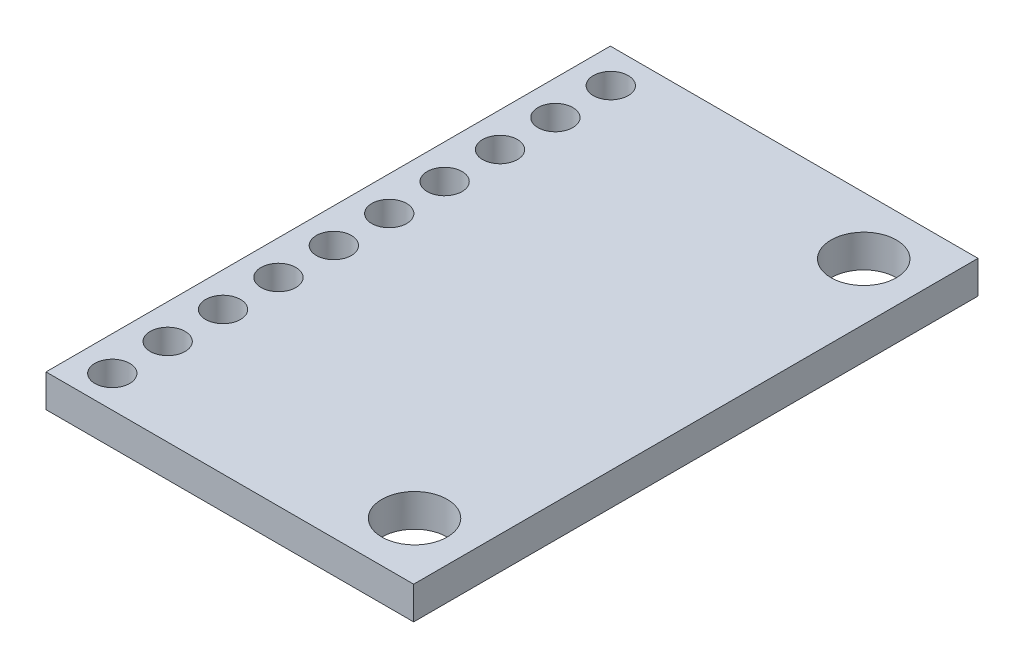
ISO-10303-21;
HEADER;
FILE_DESCRIPTION(('STEP AP214'),'2;1');
FILE_NAME('part.step','',(''),(''),'','','');
FILE_SCHEMA(('AUTOMOTIVE_DESIGN { 1 0 10303 214 1 1 1 1 }'));
ENDSEC;
DATA;
#1=APPLICATION_CONTEXT('core data for automotive mechanical design processes');
#2=APPLICATION_PROTOCOL_DEFINITION('international standard','automotive_design',2000,#1);
#3=PRODUCT_CONTEXT('',#1,'mechanical');
#4=PRODUCT('Part','Part','',(#3));
#5=PRODUCT_RELATED_PRODUCT_CATEGORY('part','',(#4));
#6=PRODUCT_DEFINITION_FORMATION('','',#4);
#7=PRODUCT_DEFINITION_CONTEXT('part definition',#1,'design');
#8=PRODUCT_DEFINITION('design','',#6,#7);
#9=PRODUCT_DEFINITION_SHAPE('','',#8);
#10=(LENGTH_UNIT() NAMED_UNIT(*) SI_UNIT(.MILLI.,.METRE.));
#11=(NAMED_UNIT(*) PLANE_ANGLE_UNIT() SI_UNIT($,.RADIAN.));
#12=(NAMED_UNIT(*) SI_UNIT($,.STERADIAN.) SOLID_ANGLE_UNIT());
#13=UNCERTAINTY_MEASURE_WITH_UNIT(LENGTH_MEASURE(1.E-05),#10,'distance_accuracy_value','');
#14=(GEOMETRIC_REPRESENTATION_CONTEXT(3) GLOBAL_UNCERTAINTY_ASSIGNED_CONTEXT((#13)) GLOBAL_UNIT_ASSIGNED_CONTEXT((#10,
#11,#12)) REPRESENTATION_CONTEXT('',''));
#15=CARTESIAN_POINT('',(0.,0.,0.));
#16=DIRECTION('',(0.,0.,1.));
#17=DIRECTION('',(1.,0.,0.));
#18=AXIS2_PLACEMENT_3D('',#15,#16,#17);
#19=CARTESIAN_POINT('',(0.,1.5,0.));
#20=DIRECTION('',(1.,0.,0.));
#21=DIRECTION('',(0.,0.,-1.));
#22=AXIS2_PLACEMENT_3D('',#19,#20,#21);
#23=PLANE('',#22);
#24=DIRECTION('',(0.,0.,1.));
#25=VECTOR('',#24,1.);
#26=CARTESIAN_POINT('',(0.,0.,0.));
#27=LINE('',#26,#25);
#28=CARTESIAN_POINT('',(0.,0.,-25.88));
#29=VERTEX_POINT('',#28);
#30=CARTESIAN_POINT('',(0.,0.,0.));
#31=VERTEX_POINT('',#30);
#32=EDGE_CURVE('E98',#29,#31,#27,.T.);
#33=ORIENTED_EDGE('',*,*,#32,.T.);
#34=DIRECTION('',(0.,-1.,0.));
#35=VECTOR('',#34,1.);
#36=CARTESIAN_POINT('',(0.,1.5,0.));
#37=LINE('',#36,#35);
#38=CARTESIAN_POINT('',(0.,1.5,0.));
#39=VERTEX_POINT('',#38);
#40=EDGE_CURVE('E11',#39,#31,#37,.T.);
#41=ORIENTED_EDGE('',*,*,#40,.F.);
#42=DIRECTION('',(0.,0.,1.));
#43=VECTOR('',#42,1.);
#44=CARTESIAN_POINT('',(0.,1.5,0.));
#45=LINE('',#44,#43);
#46=CARTESIAN_POINT('',(0.,1.5,-25.88));
#47=VERTEX_POINT('',#46);
#48=EDGE_CURVE('E86',#47,#39,#45,.T.);
#49=ORIENTED_EDGE('',*,*,#48,.F.);
#50=DIRECTION('',(0.,-1.,0.));
#51=VECTOR('',#50,1.);
#52=CARTESIAN_POINT('',(0.,1.5,-25.88));
#53=LINE('',#52,#51);
#54=EDGE_CURVE('E94',#47,#29,#53,.T.);
#55=ORIENTED_EDGE('',*,*,#54,.T.);
#56=EDGE_LOOP('',(#33,#41,#49,#55));
#57=FACE_BOUND('',#56,.T.);
#58=ADVANCED_FACE('F35',(#57),#23,.F.);
#59=CARTESIAN_POINT('',(0.,1.5,0.));
#60=DIRECTION('',(0.,0.,-1.));
#61=DIRECTION('',(-1.,0.,0.));
#62=AXIS2_PLACEMENT_3D('',#59,#60,#61);
#63=PLANE('',#62);
#64=DIRECTION('',(1.,0.,0.));
#65=VECTOR('',#64,1.);
#66=CARTESIAN_POINT('',(0.,0.,0.));
#67=LINE('',#66,#65);
#68=CARTESIAN_POINT('',(16.86,0.,0.));
#69=VERTEX_POINT('',#68);
#70=EDGE_CURVE('E90',#31,#69,#67,.T.);
#71=ORIENTED_EDGE('',*,*,#70,.T.);
#72=DIRECTION('',(0.,-1.,0.));
#73=VECTOR('',#72,1.);
#74=CARTESIAN_POINT('',(16.86,1.5,0.));
#75=LINE('',#74,#73);
#76=CARTESIAN_POINT('',(16.86,1.5,0.));
#77=VERTEX_POINT('',#76);
#78=EDGE_CURVE('E43',#77,#69,#75,.T.);
#79=ORIENTED_EDGE('',*,*,#78,.F.);
#80=DIRECTION('',(1.,0.,0.));
#81=VECTOR('',#80,1.);
#82=CARTESIAN_POINT('',(0.,1.5,0.));
#83=LINE('',#82,#81);
#84=EDGE_CURVE('E81',#39,#77,#83,.T.);
#85=ORIENTED_EDGE('',*,*,#84,.F.);
#86=ORIENTED_EDGE('',*,*,#40,.T.);
#87=EDGE_LOOP('',(#71,#79,#85,#86));
#88=FACE_BOUND('',#87,.T.);
#89=ADVANCED_FACE('F89',(#88),#63,.F.);
#90=CARTESIAN_POINT('',(16.86,1.5,0.));
#91=DIRECTION('',(-1.,0.,0.));
#92=DIRECTION('',(0.,0.,1.));
#93=AXIS2_PLACEMENT_3D('',#90,#91,#92);
#94=PLANE('',#93);
#95=DIRECTION('',(0.,0.,-1.));
#96=VECTOR('',#95,1.);
#97=CARTESIAN_POINT('',(16.86,0.,0.));
#98=LINE('',#97,#96);
#99=CARTESIAN_POINT('',(16.86,0.,-25.88));
#100=VERTEX_POINT('',#99);
#101=EDGE_CURVE('E68',#69,#100,#98,.T.);
#102=ORIENTED_EDGE('',*,*,#101,.T.);
#103=DIRECTION('',(0.,-1.,0.));
#104=VECTOR('',#103,1.);
#105=CARTESIAN_POINT('',(16.86,1.5,-25.88));
#106=LINE('',#105,#104);
#107=CARTESIAN_POINT('',(16.86,1.5,-25.88));
#108=VERTEX_POINT('',#107);
#109=EDGE_CURVE('E91',#108,#100,#106,.T.);
#110=ORIENTED_EDGE('',*,*,#109,.F.);
#111=DIRECTION('',(0.,0.,-1.));
#112=VECTOR('',#111,1.);
#113=CARTESIAN_POINT('',(16.86,1.5,0.));
#114=LINE('',#113,#112);
#115=EDGE_CURVE('E84',#77,#108,#114,.T.);
#116=ORIENTED_EDGE('',*,*,#115,.F.);
#117=ORIENTED_EDGE('',*,*,#78,.T.);
#118=EDGE_LOOP('',(#102,#110,#116,#117));
#119=FACE_BOUND('',#118,.T.);
#120=ADVANCED_FACE('F92',(#119),#94,.F.);
#121=CARTESIAN_POINT('',(0.,1.5,-25.88));
#122=DIRECTION('',(0.,0.,1.));
#123=DIRECTION('',(1.,0.,0.));
#124=AXIS2_PLACEMENT_3D('',#121,#122,#123);
#125=PLANE('',#124);
#126=DIRECTION('',(-1.,0.,0.));
#127=VECTOR('',#126,1.);
#128=CARTESIAN_POINT('',(0.,0.,-25.88));
#129=LINE('',#128,#127);
#130=EDGE_CURVE('E74',#100,#29,#129,.T.);
#131=ORIENTED_EDGE('',*,*,#130,.T.);
#132=ORIENTED_EDGE('',*,*,#54,.F.);
#133=DIRECTION('',(-1.,0.,0.));
#134=VECTOR('',#133,1.);
#135=CARTESIAN_POINT('',(0.,1.5,-25.88));
#136=LINE('',#135,#134);
#137=EDGE_CURVE('E51',#108,#47,#136,.T.);
#138=ORIENTED_EDGE('',*,*,#137,.F.);
#139=ORIENTED_EDGE('',*,*,#109,.T.);
#140=EDGE_LOOP('',(#131,#132,#138,#139));
#141=FACE_BOUND('',#140,.T.);
#142=ADVANCED_FACE('F106',(#141),#125,.F.);
#143=CARTESIAN_POINT('',(0.,1.5,0.));
#144=DIRECTION('',(0.,-1.,0.));
#145=DIRECTION('',(0.,0.,-1.));
#146=AXIS2_PLACEMENT_3D('',#143,#144,#145);
#147=PLANE('',#146);
#148=CARTESIAN_POINT('',(1.58,1.5,-1.46));
#149=DIRECTION('',(0.,1.,0.));
#150=DIRECTION('',(0.,0.,1.));
#151=AXIS2_PLACEMENT_3D('',#148,#149,#150);
#152=CIRCLE('',#151,0.799999999999998);
#153=CARTESIAN_POINT('',(1.58,1.5,-0.660000000000001));
#154=VERTEX_POINT('',#153);
#155=EDGE_CURVE('E175',#154,#154,#152,.T.);
#156=ORIENTED_EDGE('',*,*,#155,.F.);
#157=EDGE_LOOP('',(#156));
#158=FACE_BOUND('',#157,.T.);
#159=CARTESIAN_POINT('',(1.58,1.5,-4.));
#160=DIRECTION('',(0.,1.,0.));
#161=DIRECTION('',(0.,0.,1.));
#162=AXIS2_PLACEMENT_3D('',#159,#160,#161);
#163=CIRCLE('',#162,0.799999999999998);
#164=CARTESIAN_POINT('',(1.58,1.5,-3.2));
#165=VERTEX_POINT('',#164);
#166=EDGE_CURVE('E169',#165,#165,#163,.T.);
#167=ORIENTED_EDGE('',*,*,#166,.F.);
#168=EDGE_LOOP('',(#167));
#169=FACE_BOUND('',#168,.T.);
#170=CARTESIAN_POINT('',(1.58,1.5,-6.54));
#171=DIRECTION('',(0.,1.,0.));
#172=DIRECTION('',(0.,0.,1.));
#173=AXIS2_PLACEMENT_3D('',#170,#171,#172);
#174=CIRCLE('',#173,0.799999999999998);
#175=CARTESIAN_POINT('',(1.58,1.5,-5.74));
#176=VERTEX_POINT('',#175);
#177=EDGE_CURVE('E163',#176,#176,#174,.T.);
#178=ORIENTED_EDGE('',*,*,#177,.F.);
#179=EDGE_LOOP('',(#178));
#180=FACE_BOUND('',#179,.T.);
#181=CARTESIAN_POINT('',(1.58,1.5,-9.08));
#182=DIRECTION('',(0.,1.,0.));
#183=DIRECTION('',(0.,0.,1.));
#184=AXIS2_PLACEMENT_3D('',#181,#182,#183);
#185=CIRCLE('',#184,0.799999999999998);
#186=CARTESIAN_POINT('',(1.58,1.5,-8.28));
#187=VERTEX_POINT('',#186);
#188=EDGE_CURVE('E157',#187,#187,#185,.T.);
#189=ORIENTED_EDGE('',*,*,#188,.F.);
#190=EDGE_LOOP('',(#189));
#191=FACE_BOUND('',#190,.T.);
#192=CARTESIAN_POINT('',(1.58,1.5,-11.62));
#193=DIRECTION('',(0.,1.,0.));
#194=DIRECTION('',(0.,0.,1.));
#195=AXIS2_PLACEMENT_3D('',#192,#193,#194);
#196=CIRCLE('',#195,0.799999999999998);
#197=CARTESIAN_POINT('',(1.58,1.5,-10.82));
#198=VERTEX_POINT('',#197);
#199=EDGE_CURVE('E151',#198,#198,#196,.T.);
#200=ORIENTED_EDGE('',*,*,#199,.F.);
#201=EDGE_LOOP('',(#200));
#202=FACE_BOUND('',#201,.T.);
#203=CARTESIAN_POINT('',(1.58,1.5,-14.16));
#204=DIRECTION('',(0.,1.,0.));
#205=DIRECTION('',(0.,0.,1.));
#206=AXIS2_PLACEMENT_3D('',#203,#204,#205);
#207=CIRCLE('',#206,0.799999999999998);
#208=CARTESIAN_POINT('',(1.58,1.5,-13.36));
#209=VERTEX_POINT('',#208);
#210=EDGE_CURVE('E145',#209,#209,#207,.T.);
#211=ORIENTED_EDGE('',*,*,#210,.F.);
#212=EDGE_LOOP('',(#211));
#213=FACE_BOUND('',#212,.T.);
#214=CARTESIAN_POINT('',(1.58,1.5,-16.7));
#215=DIRECTION('',(0.,1.,0.));
#216=DIRECTION('',(0.,0.,1.));
#217=AXIS2_PLACEMENT_3D('',#214,#215,#216);
#218=CIRCLE('',#217,0.799999999999999);
#219=CARTESIAN_POINT('',(1.58,1.5,-15.9));
#220=VERTEX_POINT('',#219);
#221=EDGE_CURVE('E139',#220,#220,#218,.T.);
#222=ORIENTED_EDGE('',*,*,#221,.F.);
#223=EDGE_LOOP('',(#222));
#224=FACE_BOUND('',#223,.T.);
#225=CARTESIAN_POINT('',(1.58,1.5,-19.24));
#226=DIRECTION('',(0.,1.,0.));
#227=DIRECTION('',(0.,0.,1.));
#228=AXIS2_PLACEMENT_3D('',#225,#226,#227);
#229=CIRCLE('',#228,0.799999999999998);
#230=CARTESIAN_POINT('',(1.58,1.5,-18.44));
#231=VERTEX_POINT('',#230);
#232=EDGE_CURVE('E133',#231,#231,#229,.T.);
#233=ORIENTED_EDGE('',*,*,#232,.F.);
#234=EDGE_LOOP('',(#233));
#235=FACE_BOUND('',#234,.T.);
#236=CARTESIAN_POINT('',(1.58,1.5,-21.78));
#237=DIRECTION('',(0.,1.,0.));
#238=DIRECTION('',(0.,0.,1.));
#239=AXIS2_PLACEMENT_3D('',#236,#237,#238);
#240=CIRCLE('',#239,0.799999999999998);
#241=CARTESIAN_POINT('',(1.58,1.5,-20.98));
#242=VERTEX_POINT('',#241);
#243=EDGE_CURVE('E127',#242,#242,#240,.T.);
#244=ORIENTED_EDGE('',*,*,#243,.F.);
#245=EDGE_LOOP('',(#244));
#246=FACE_BOUND('',#245,.T.);
#247=CARTESIAN_POINT('',(1.58,1.5,-24.32));
#248=DIRECTION('',(0.,1.,0.));
#249=DIRECTION('',(0.,0.,1.));
#250=AXIS2_PLACEMENT_3D('',#247,#248,#249);
#251=CIRCLE('',#250,0.799999999999998);
#252=CARTESIAN_POINT('',(1.58,1.5,-23.52));
#253=VERTEX_POINT('',#252);
#254=EDGE_CURVE('E121',#253,#253,#251,.T.);
#255=ORIENTED_EDGE('',*,*,#254,.F.);
#256=EDGE_LOOP('',(#255));
#257=FACE_BOUND('',#256,.T.);
#258=CARTESIAN_POINT('',(14.26,1.5,-2.64));
#259=DIRECTION('',(0.,1.,0.));
#260=DIRECTION('',(0.,0.,1.));
#261=AXIS2_PLACEMENT_3D('',#258,#259,#260);
#262=CIRCLE('',#261,1.5);
#263=CARTESIAN_POINT('',(14.26,1.5,-1.14));
#264=VERTEX_POINT('',#263);
#265=EDGE_CURVE('E115',#264,#264,#262,.T.);
#266=ORIENTED_EDGE('',*,*,#265,.F.);
#267=EDGE_LOOP('',(#266));
#268=FACE_BOUND('',#267,.T.);
#269=CARTESIAN_POINT('',(14.26,1.5,-23.24));
#270=DIRECTION('',(0.,1.,0.));
#271=DIRECTION('',(0.,0.,1.));
#272=AXIS2_PLACEMENT_3D('',#269,#270,#271);
#273=CIRCLE('',#272,1.5);
#274=CARTESIAN_POINT('',(14.26,1.5,-21.74));
#275=VERTEX_POINT('',#274);
#276=EDGE_CURVE('E101',#275,#275,#273,.T.);
#277=ORIENTED_EDGE('',*,*,#276,.F.);
#278=EDGE_LOOP('',(#277));
#279=FACE_BOUND('',#278,.T.);
#280=ORIENTED_EDGE('',*,*,#48,.T.);
#281=ORIENTED_EDGE('',*,*,#84,.T.);
#282=ORIENTED_EDGE('',*,*,#115,.T.);
#283=ORIENTED_EDGE('',*,*,#137,.T.);
#284=EDGE_LOOP('',(#280,#281,#282,#283));
#285=FACE_BOUND('',#284,.T.);
#286=ADVANCED_FACE('F82',(#158,#169,#180,#191,#202,#213,#224,#235,#246,#257,#268,#279,#285),
#147,.F.);
#287=CARTESIAN_POINT('',(0.,0.,0.));
#288=DIRECTION('',(0.,-1.,0.));
#289=DIRECTION('',(0.,0.,-1.));
#290=AXIS2_PLACEMENT_3D('',#287,#288,#289);
#291=PLANE('',#290);
#292=CARTESIAN_POINT('',(1.58,0.,-1.46));
#293=DIRECTION('',(0.,-1.,0.));
#294=DIRECTION('',(0.,0.,-1.));
#295=AXIS2_PLACEMENT_3D('',#292,#293,#294);
#296=CIRCLE('',#295,0.799999999999998);
#297=CARTESIAN_POINT('',(1.58,0.,-2.26));
#298=VERTEX_POINT('',#297);
#299=EDGE_CURVE('E178',#298,#298,#296,.F.);
#300=ORIENTED_EDGE('',*,*,#299,.T.);
#301=EDGE_LOOP('',(#300));
#302=FACE_BOUND('',#301,.T.);
#303=CARTESIAN_POINT('',(1.58,0.,-4.));
#304=DIRECTION('',(0.,-1.,0.));
#305=DIRECTION('',(0.,0.,-1.));
#306=AXIS2_PLACEMENT_3D('',#303,#304,#305);
#307=CIRCLE('',#306,0.799999999999998);
#308=CARTESIAN_POINT('',(1.58,0.,-4.8));
#309=VERTEX_POINT('',#308);
#310=EDGE_CURVE('E172',#309,#309,#307,.F.);
#311=ORIENTED_EDGE('',*,*,#310,.T.);
#312=EDGE_LOOP('',(#311));
#313=FACE_BOUND('',#312,.T.);
#314=CARTESIAN_POINT('',(1.58,0.,-6.54));
#315=DIRECTION('',(0.,-1.,0.));
#316=DIRECTION('',(0.,0.,-1.));
#317=AXIS2_PLACEMENT_3D('',#314,#315,#316);
#318=CIRCLE('',#317,0.799999999999998);
#319=CARTESIAN_POINT('',(1.58,0.,-7.34));
#320=VERTEX_POINT('',#319);
#321=EDGE_CURVE('E166',#320,#320,#318,.F.);
#322=ORIENTED_EDGE('',*,*,#321,.T.);
#323=EDGE_LOOP('',(#322));
#324=FACE_BOUND('',#323,.T.);
#325=CARTESIAN_POINT('',(1.58,0.,-9.08));
#326=DIRECTION('',(0.,-1.,0.));
#327=DIRECTION('',(0.,0.,-1.));
#328=AXIS2_PLACEMENT_3D('',#325,#326,#327);
#329=CIRCLE('',#328,0.799999999999998);
#330=CARTESIAN_POINT('',(1.58,0.,-9.88));
#331=VERTEX_POINT('',#330);
#332=EDGE_CURVE('E160',#331,#331,#329,.F.);
#333=ORIENTED_EDGE('',*,*,#332,.T.);
#334=EDGE_LOOP('',(#333));
#335=FACE_BOUND('',#334,.T.);
#336=CARTESIAN_POINT('',(1.58,0.,-11.62));
#337=DIRECTION('',(0.,-1.,0.));
#338=DIRECTION('',(0.,0.,-1.));
#339=AXIS2_PLACEMENT_3D('',#336,#337,#338);
#340=CIRCLE('',#339,0.799999999999998);
#341=CARTESIAN_POINT('',(1.58,0.,-12.42));
#342=VERTEX_POINT('',#341);
#343=EDGE_CURVE('E154',#342,#342,#340,.F.);
#344=ORIENTED_EDGE('',*,*,#343,.T.);
#345=EDGE_LOOP('',(#344));
#346=FACE_BOUND('',#345,.T.);
#347=CARTESIAN_POINT('',(1.58,0.,-14.16));
#348=DIRECTION('',(0.,-1.,0.));
#349=DIRECTION('',(0.,0.,-1.));
#350=AXIS2_PLACEMENT_3D('',#347,#348,#349);
#351=CIRCLE('',#350,0.799999999999998);
#352=CARTESIAN_POINT('',(1.58,0.,-14.96));
#353=VERTEX_POINT('',#352);
#354=EDGE_CURVE('E148',#353,#353,#351,.F.);
#355=ORIENTED_EDGE('',*,*,#354,.T.);
#356=EDGE_LOOP('',(#355));
#357=FACE_BOUND('',#356,.T.);
#358=CARTESIAN_POINT('',(1.58,0.,-16.7));
#359=DIRECTION('',(0.,-1.,0.));
#360=DIRECTION('',(0.,0.,-1.));
#361=AXIS2_PLACEMENT_3D('',#358,#359,#360);
#362=CIRCLE('',#361,0.799999999999999);
#363=CARTESIAN_POINT('',(1.58,0.,-17.5));
#364=VERTEX_POINT('',#363);
#365=EDGE_CURVE('E142',#364,#364,#362,.F.);
#366=ORIENTED_EDGE('',*,*,#365,.T.);
#367=EDGE_LOOP('',(#366));
#368=FACE_BOUND('',#367,.T.);
#369=CARTESIAN_POINT('',(1.58,0.,-19.24));
#370=DIRECTION('',(0.,-1.,0.));
#371=DIRECTION('',(0.,0.,-1.));
#372=AXIS2_PLACEMENT_3D('',#369,#370,#371);
#373=CIRCLE('',#372,0.799999999999998);
#374=CARTESIAN_POINT('',(1.58,0.,-20.04));
#375=VERTEX_POINT('',#374);
#376=EDGE_CURVE('E136',#375,#375,#373,.F.);
#377=ORIENTED_EDGE('',*,*,#376,.T.);
#378=EDGE_LOOP('',(#377));
#379=FACE_BOUND('',#378,.T.);
#380=CARTESIAN_POINT('',(1.58,0.,-21.78));
#381=DIRECTION('',(0.,-1.,0.));
#382=DIRECTION('',(0.,0.,-1.));
#383=AXIS2_PLACEMENT_3D('',#380,#381,#382);
#384=CIRCLE('',#383,0.799999999999998);
#385=CARTESIAN_POINT('',(1.58,0.,-22.58));
#386=VERTEX_POINT('',#385);
#387=EDGE_CURVE('E130',#386,#386,#384,.F.);
#388=ORIENTED_EDGE('',*,*,#387,.T.);
#389=EDGE_LOOP('',(#388));
#390=FACE_BOUND('',#389,.T.);
#391=CARTESIAN_POINT('',(1.58,0.,-24.32));
#392=DIRECTION('',(0.,-1.,0.));
#393=DIRECTION('',(0.,0.,-1.));
#394=AXIS2_PLACEMENT_3D('',#391,#392,#393);
#395=CIRCLE('',#394,0.799999999999998);
#396=CARTESIAN_POINT('',(1.58,0.,-25.12));
#397=VERTEX_POINT('',#396);
#398=EDGE_CURVE('E124',#397,#397,#395,.F.);
#399=ORIENTED_EDGE('',*,*,#398,.T.);
#400=EDGE_LOOP('',(#399));
#401=FACE_BOUND('',#400,.T.);
#402=CARTESIAN_POINT('',(14.26,0.,-2.64));
#403=DIRECTION('',(0.,-1.,0.));
#404=DIRECTION('',(0.,0.,-1.));
#405=AXIS2_PLACEMENT_3D('',#402,#403,#404);
#406=CIRCLE('',#405,1.5);
#407=CARTESIAN_POINT('',(14.26,0.,-4.14));
#408=VERTEX_POINT('',#407);
#409=EDGE_CURVE('E118',#408,#408,#406,.F.);
#410=ORIENTED_EDGE('',*,*,#409,.T.);
#411=EDGE_LOOP('',(#410));
#412=FACE_BOUND('',#411,.T.);
#413=CARTESIAN_POINT('',(14.26,0.,-23.24));
#414=DIRECTION('',(0.,-1.,0.));
#415=DIRECTION('',(0.,0.,-1.));
#416=AXIS2_PLACEMENT_3D('',#413,#414,#415);
#417=CIRCLE('',#416,1.5);
#418=CARTESIAN_POINT('',(14.26,0.,-24.74));
#419=VERTEX_POINT('',#418);
#420=EDGE_CURVE('E112',#419,#419,#417,.F.);
#421=ORIENTED_EDGE('',*,*,#420,.T.);
#422=EDGE_LOOP('',(#421));
#423=FACE_BOUND('',#422,.T.);
#424=ORIENTED_EDGE('',*,*,#32,.F.);
#425=ORIENTED_EDGE('',*,*,#130,.F.);
#426=ORIENTED_EDGE('',*,*,#101,.F.);
#427=ORIENTED_EDGE('',*,*,#70,.F.);
#428=EDGE_LOOP('',(#424,#425,#426,#427));
#429=FACE_BOUND('',#428,.T.);
#430=ADVANCED_FACE('F109',(#302,#313,#324,#335,#346,#357,#368,#379,#390,#401,#412,#423,#429),
#291,.T.);
#431=CARTESIAN_POINT('',(14.26,-0.000999999999999916,-23.24));
#432=DIRECTION('',(0.,1.,0.));
#433=DIRECTION('',(0.,0.,1.));
#434=AXIS2_PLACEMENT_3D('',#431,#432,#433);
#435=CYLINDRICAL_SURFACE('',#434,1.5);
#436=ORIENTED_EDGE('',*,*,#420,.F.);
#437=EDGE_LOOP('',(#436));
#438=FACE_BOUND('',#437,.T.);
#439=ORIENTED_EDGE('',*,*,#276,.T.);
#440=EDGE_LOOP('',(#439));
#441=FACE_BOUND('',#440,.T.);
#442=ADVANCED_FACE('F211',(#438,#441),#435,.F.);
#443=CARTESIAN_POINT('',(14.26,-0.000999999999999916,-2.64));
#444=DIRECTION('',(0.,1.,0.));
#445=DIRECTION('',(0.,0.,1.));
#446=AXIS2_PLACEMENT_3D('',#443,#444,#445);
#447=CYLINDRICAL_SURFACE('',#446,1.5);
#448=ORIENTED_EDGE('',*,*,#409,.F.);
#449=EDGE_LOOP('',(#448));
#450=FACE_BOUND('',#449,.T.);
#451=ORIENTED_EDGE('',*,*,#265,.T.);
#452=EDGE_LOOP('',(#451));
#453=FACE_BOUND('',#452,.T.);
#454=ADVANCED_FACE('F213',(#450,#453),#447,.F.);
#455=CARTESIAN_POINT('',(1.58,-0.000999999999999916,-24.32));
#456=DIRECTION('',(0.,1.,0.));
#457=DIRECTION('',(0.,0.,1.));
#458=AXIS2_PLACEMENT_3D('',#455,#456,#457);
#459=CYLINDRICAL_SURFACE('',#458,0.799999999999998);
#460=ORIENTED_EDGE('',*,*,#398,.F.);
#461=EDGE_LOOP('',(#460));
#462=FACE_BOUND('',#461,.T.);
#463=ORIENTED_EDGE('',*,*,#254,.T.);
#464=EDGE_LOOP('',(#463));
#465=FACE_BOUND('',#464,.T.);
#466=ADVANCED_FACE('F220',(#462,#465),#459,.F.);
#467=CARTESIAN_POINT('',(1.58,-0.000999999999999916,-21.78));
#468=DIRECTION('',(0.,1.,0.));
#469=DIRECTION('',(0.,0.,1.));
#470=AXIS2_PLACEMENT_3D('',#467,#468,#469);
#471=CYLINDRICAL_SURFACE('',#470,0.799999999999998);
#472=ORIENTED_EDGE('',*,*,#387,.F.);
#473=EDGE_LOOP('',(#472));
#474=FACE_BOUND('',#473,.T.);
#475=ORIENTED_EDGE('',*,*,#243,.T.);
#476=EDGE_LOOP('',(#475));
#477=FACE_BOUND('',#476,.T.);
#478=ADVANCED_FACE('F260',(#474,#477),#471,.F.);
#479=CARTESIAN_POINT('',(1.58,-0.000999999999999916,-19.24));
#480=DIRECTION('',(0.,1.,0.));
#481=DIRECTION('',(0.,0.,1.));
#482=AXIS2_PLACEMENT_3D('',#479,#480,#481);
#483=CYLINDRICAL_SURFACE('',#482,0.799999999999998);
#484=ORIENTED_EDGE('',*,*,#376,.F.);
#485=EDGE_LOOP('',(#484));
#486=FACE_BOUND('',#485,.T.);
#487=ORIENTED_EDGE('',*,*,#232,.T.);
#488=EDGE_LOOP('',(#487));
#489=FACE_BOUND('',#488,.T.);
#490=ADVANCED_FACE('F271',(#486,#489),#483,.F.);
#491=CARTESIAN_POINT('',(1.58,-0.000999999999999916,-16.7));
#492=DIRECTION('',(0.,1.,0.));
#493=DIRECTION('',(0.,0.,1.));
#494=AXIS2_PLACEMENT_3D('',#491,#492,#493);
#495=CYLINDRICAL_SURFACE('',#494,0.799999999999999);
#496=ORIENTED_EDGE('',*,*,#365,.F.);
#497=EDGE_LOOP('',(#496));
#498=FACE_BOUND('',#497,.T.);
#499=ORIENTED_EDGE('',*,*,#221,.T.);
#500=EDGE_LOOP('',(#499));
#501=FACE_BOUND('',#500,.T.);
#502=ADVANCED_FACE('F281',(#498,#501),#495,.F.);
#503=CARTESIAN_POINT('',(1.58,-0.000999999999999916,-14.16));
#504=DIRECTION('',(0.,1.,0.));
#505=DIRECTION('',(0.,0.,1.));
#506=AXIS2_PLACEMENT_3D('',#503,#504,#505);
#507=CYLINDRICAL_SURFACE('',#506,0.799999999999998);
#508=ORIENTED_EDGE('',*,*,#354,.F.);
#509=EDGE_LOOP('',(#508));
#510=FACE_BOUND('',#509,.T.);
#511=ORIENTED_EDGE('',*,*,#210,.T.);
#512=EDGE_LOOP('',(#511));
#513=FACE_BOUND('',#512,.T.);
#514=ADVANCED_FACE('F291',(#510,#513),#507,.F.);
#515=CARTESIAN_POINT('',(1.58,-0.000999999999999916,-11.62));
#516=DIRECTION('',(0.,1.,0.));
#517=DIRECTION('',(0.,0.,1.));
#518=AXIS2_PLACEMENT_3D('',#515,#516,#517);
#519=CYLINDRICAL_SURFACE('',#518,0.799999999999998);
#520=ORIENTED_EDGE('',*,*,#343,.F.);
#521=EDGE_LOOP('',(#520));
#522=FACE_BOUND('',#521,.T.);
#523=ORIENTED_EDGE('',*,*,#199,.T.);
#524=EDGE_LOOP('',(#523));
#525=FACE_BOUND('',#524,.T.);
#526=ADVANCED_FACE('F301',(#522,#525),#519,.F.);
#527=CARTESIAN_POINT('',(1.58,-0.000999999999999916,-9.08));
#528=DIRECTION('',(0.,1.,0.));
#529=DIRECTION('',(0.,0.,1.));
#530=AXIS2_PLACEMENT_3D('',#527,#528,#529);
#531=CYLINDRICAL_SURFACE('',#530,0.799999999999998);
#532=ORIENTED_EDGE('',*,*,#332,.F.);
#533=EDGE_LOOP('',(#532));
#534=FACE_BOUND('',#533,.T.);
#535=ORIENTED_EDGE('',*,*,#188,.T.);
#536=EDGE_LOOP('',(#535));
#537=FACE_BOUND('',#536,.T.);
#538=ADVANCED_FACE('F311',(#534,#537),#531,.F.);
#539=CARTESIAN_POINT('',(1.58,-0.000999999999999916,-6.54));
#540=DIRECTION('',(0.,1.,0.));
#541=DIRECTION('',(0.,0.,1.));
#542=AXIS2_PLACEMENT_3D('',#539,#540,#541);
#543=CYLINDRICAL_SURFACE('',#542,0.799999999999998);
#544=ORIENTED_EDGE('',*,*,#321,.F.);
#545=EDGE_LOOP('',(#544));
#546=FACE_BOUND('',#545,.T.);
#547=ORIENTED_EDGE('',*,*,#177,.T.);
#548=EDGE_LOOP('',(#547));
#549=FACE_BOUND('',#548,.T.);
#550=ADVANCED_FACE('F321',(#546,#549),#543,.F.);
#551=CARTESIAN_POINT('',(1.58,-0.000999999999999916,-4.));
#552=DIRECTION('',(0.,1.,0.));
#553=DIRECTION('',(0.,0.,1.));
#554=AXIS2_PLACEMENT_3D('',#551,#552,#553);
#555=CYLINDRICAL_SURFACE('',#554,0.799999999999998);
#556=ORIENTED_EDGE('',*,*,#310,.F.);
#557=EDGE_LOOP('',(#556));
#558=FACE_BOUND('',#557,.T.);
#559=ORIENTED_EDGE('',*,*,#166,.T.);
#560=EDGE_LOOP('',(#559));
#561=FACE_BOUND('',#560,.T.);
#562=ADVANCED_FACE('F331',(#558,#561),#555,.F.);
#563=CARTESIAN_POINT('',(1.58,-0.000999999999999916,-1.46));
#564=DIRECTION('',(0.,1.,0.));
#565=DIRECTION('',(0.,0.,1.));
#566=AXIS2_PLACEMENT_3D('',#563,#564,#565);
#567=CYLINDRICAL_SURFACE('',#566,0.799999999999998);
#568=ORIENTED_EDGE('',*,*,#299,.F.);
#569=EDGE_LOOP('',(#568));
#570=FACE_BOUND('',#569,.T.);
#571=ORIENTED_EDGE('',*,*,#155,.T.);
#572=EDGE_LOOP('',(#571));
#573=FACE_BOUND('',#572,.T.);
#574=ADVANCED_FACE('F184',(#570,#573),#567,.F.);
#575=CLOSED_SHELL('',(#58,#89,#120,#142,#286,#430,#442,#454,#466,#478,#490,#502,#514,#526,#538,
#550,#562,#574));
#576=MANIFOLD_SOLID_BREP('B2',#575);
#577=ADVANCED_BREP_SHAPE_REPRESENTATION('',(#18,#576),#14);
#578=SHAPE_DEFINITION_REPRESENTATION(#9,#577);
ENDSEC;
END-ISO-10303-21;
